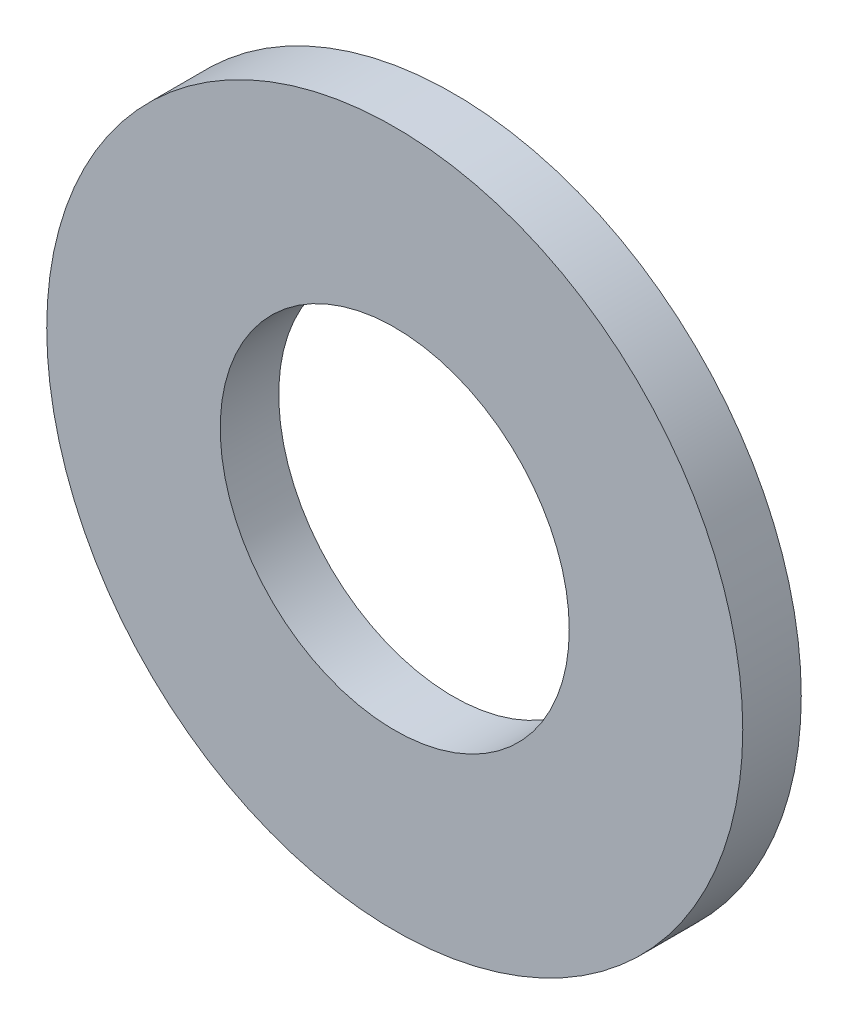
ISO-10303-21;
HEADER;
FILE_DESCRIPTION(('STEP AP214'),'2;1');
FILE_NAME('part.step','',(''),(''),'','','');
FILE_SCHEMA(('AUTOMOTIVE_DESIGN { 1 0 10303 214 1 1 1 1 }'));
ENDSEC;
DATA;
#1=APPLICATION_CONTEXT('core data for automotive mechanical design processes');
#2=APPLICATION_PROTOCOL_DEFINITION('international standard','automotive_design',2000,#1);
#3=PRODUCT_CONTEXT('',#1,'mechanical');
#4=PRODUCT('Part','Part','',(#3));
#5=PRODUCT_RELATED_PRODUCT_CATEGORY('part','',(#4));
#6=PRODUCT_DEFINITION_FORMATION('','',#4);
#7=PRODUCT_DEFINITION_CONTEXT('part definition',#1,'design');
#8=PRODUCT_DEFINITION('design','',#6,#7);
#9=PRODUCT_DEFINITION_SHAPE('','',#8);
#10=(LENGTH_UNIT() NAMED_UNIT(*) SI_UNIT(.MILLI.,.METRE.));
#11=(NAMED_UNIT(*) PLANE_ANGLE_UNIT() SI_UNIT($,.RADIAN.));
#12=(NAMED_UNIT(*) SI_UNIT($,.STERADIAN.) SOLID_ANGLE_UNIT());
#13=UNCERTAINTY_MEASURE_WITH_UNIT(LENGTH_MEASURE(1.E-05),#10,'distance_accuracy_value','');
#14=(GEOMETRIC_REPRESENTATION_CONTEXT(3) GLOBAL_UNCERTAINTY_ASSIGNED_CONTEXT((#13)) GLOBAL_UNIT_ASSIGNED_CONTEXT((#10,
#11,#12)) REPRESENTATION_CONTEXT('',''));
#15=CARTESIAN_POINT('',(0.,0.,0.));
#16=DIRECTION('',(0.,0.,1.));
#17=DIRECTION('',(1.,0.,0.));
#18=AXIS2_PLACEMENT_3D('',#15,#16,#17);
#19=CARTESIAN_POINT('',(0.,0.,1.4732));
#20=DIRECTION('',(0.,0.,-1.));
#21=DIRECTION('',(-1.,0.,0.));
#22=AXIS2_PLACEMENT_3D('',#19,#20,#21);
#23=CYLINDRICAL_SURFACE('',#22,4.3942);
#24=CARTESIAN_POINT('',(0.,0.,1.4732));
#25=DIRECTION('',(0.,0.,-1.));
#26=DIRECTION('',(1.,0.,0.));
#27=AXIS2_PLACEMENT_3D('',#24,#25,#26);
#28=CIRCLE('',#27,4.3942);
#29=CARTESIAN_POINT('',(4.3942,0.,1.4732));
#30=VERTEX_POINT('',#29);
#31=EDGE_CURVE('E10',#30,#30,#28,.T.);
#32=ORIENTED_EDGE('',*,*,#31,.F.);
#33=EDGE_LOOP('',(#32));
#34=FACE_BOUND('',#33,.T.);
#35=CARTESIAN_POINT('',(0.,0.,0.));
#36=DIRECTION('',(0.,0.,-1.));
#37=DIRECTION('',(1.,0.,0.));
#38=AXIS2_PLACEMENT_3D('',#35,#36,#37);
#39=CIRCLE('',#38,4.3942);
#40=CARTESIAN_POINT('',(4.3942,0.,0.));
#41=VERTEX_POINT('',#40);
#42=EDGE_CURVE('E25',#41,#41,#39,.T.);
#43=ORIENTED_EDGE('',*,*,#42,.T.);
#44=EDGE_LOOP('',(#43));
#45=FACE_BOUND('',#44,.T.);
#46=ADVANCED_FACE('F14',(#34,#45),#23,.F.);
#47=CARTESIAN_POINT('',(0.,0.,1.4732));
#48=DIRECTION('',(0.,0.,-1.));
#49=DIRECTION('',(-1.,0.,0.));
#50=AXIS2_PLACEMENT_3D('',#47,#48,#49);
#51=CYLINDRICAL_SURFACE('',#50,8.763);
#52=CARTESIAN_POINT('',(0.,0.,1.4732));
#53=DIRECTION('',(0.,0.,-1.));
#54=DIRECTION('',(1.,0.,0.));
#55=AXIS2_PLACEMENT_3D('',#52,#53,#54);
#56=CIRCLE('',#55,8.763);
#57=CARTESIAN_POINT('',(8.763,0.,1.4732));
#58=VERTEX_POINT('',#57);
#59=EDGE_CURVE('E21',#58,#58,#56,.T.);
#60=ORIENTED_EDGE('',*,*,#59,.T.);
#61=EDGE_LOOP('',(#60));
#62=FACE_BOUND('',#61,.T.);
#63=CARTESIAN_POINT('',(0.,0.,0.));
#64=DIRECTION('',(0.,0.,-1.));
#65=DIRECTION('',(1.,0.,0.));
#66=AXIS2_PLACEMENT_3D('',#63,#64,#65);
#67=CIRCLE('',#66,8.763);
#68=CARTESIAN_POINT('',(8.763,0.,0.));
#69=VERTEX_POINT('',#68);
#70=EDGE_CURVE('E30',#69,#69,#67,.T.);
#71=ORIENTED_EDGE('',*,*,#70,.F.);
#72=EDGE_LOOP('',(#71));
#73=FACE_BOUND('',#72,.T.);
#74=ADVANCED_FACE('F16',(#62,#73),#51,.T.);
#75=CARTESIAN_POINT('',(0.,0.,1.4732));
#76=DIRECTION('',(0.,0.,-1.));
#77=DIRECTION('',(-1.,0.,0.));
#78=AXIS2_PLACEMENT_3D('',#75,#76,#77);
#79=PLANE('',#78);
#80=ORIENTED_EDGE('',*,*,#31,.T.);
#81=EDGE_LOOP('',(#80));
#82=FACE_BOUND('',#81,.T.);
#83=ORIENTED_EDGE('',*,*,#59,.F.);
#84=EDGE_LOOP('',(#83));
#85=FACE_BOUND('',#84,.T.);
#86=ADVANCED_FACE('F42',(#82,#85),#79,.F.);
#87=CARTESIAN_POINT('',(0.,0.,0.));
#88=DIRECTION('',(0.,0.,-1.));
#89=DIRECTION('',(-1.,0.,0.));
#90=AXIS2_PLACEMENT_3D('',#87,#88,#89);
#91=PLANE('',#90);
#92=ORIENTED_EDGE('',*,*,#42,.F.);
#93=EDGE_LOOP('',(#92));
#94=FACE_BOUND('',#93,.T.);
#95=ORIENTED_EDGE('',*,*,#70,.T.);
#96=EDGE_LOOP('',(#95));
#97=FACE_BOUND('',#96,.T.);
#98=ADVANCED_FACE('F39',(#94,#97),#91,.T.);
#99=CLOSED_SHELL('',(#46,#74,#86,#98));
#100=MANIFOLD_SOLID_BREP('B1',#99);
#101=ADVANCED_BREP_SHAPE_REPRESENTATION('',(#18,#100),#14);
#102=SHAPE_DEFINITION_REPRESENTATION(#9,#101);
ENDSEC;
END-ISO-10303-21;
